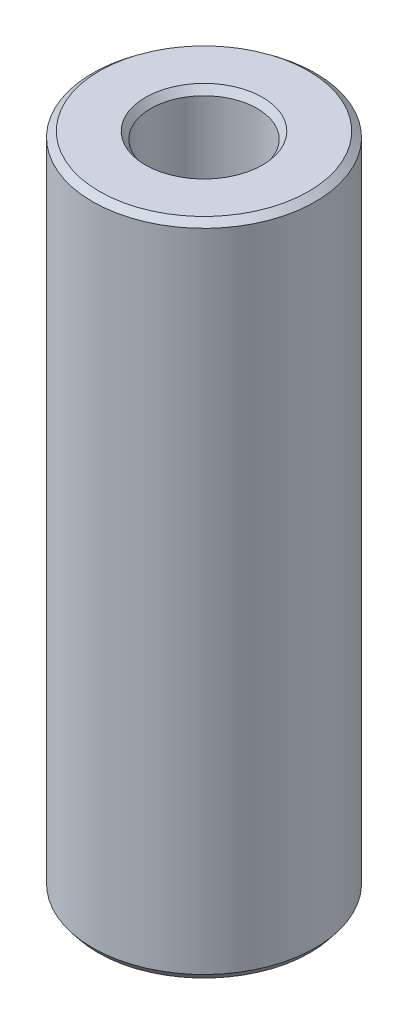
ISO-10303-21;
HEADER;
FILE_DESCRIPTION(('STEP AP214'),'2;1');
FILE_NAME('part.step','',(''),(''),'','','');
FILE_SCHEMA(('AUTOMOTIVE_DESIGN { 1 0 10303 214 1 1 1 1 }'));
ENDSEC;
DATA;
#1=APPLICATION_CONTEXT('core data for automotive mechanical design processes');
#2=APPLICATION_PROTOCOL_DEFINITION('international standard','automotive_design',2000,#1);
#3=PRODUCT_CONTEXT('',#1,'mechanical');
#4=PRODUCT('Part','Part','',(#3));
#5=PRODUCT_RELATED_PRODUCT_CATEGORY('part','',(#4));
#6=PRODUCT_DEFINITION_FORMATION('','',#4);
#7=PRODUCT_DEFINITION_CONTEXT('part definition',#1,'design');
#8=PRODUCT_DEFINITION('design','',#6,#7);
#9=PRODUCT_DEFINITION_SHAPE('','',#8);
#10=(LENGTH_UNIT() NAMED_UNIT(*) SI_UNIT(.MILLI.,.METRE.));
#11=(NAMED_UNIT(*) PLANE_ANGLE_UNIT() SI_UNIT($,.RADIAN.));
#12=(NAMED_UNIT(*) SI_UNIT($,.STERADIAN.) SOLID_ANGLE_UNIT());
#13=UNCERTAINTY_MEASURE_WITH_UNIT(LENGTH_MEASURE(1.E-05),#10,'distance_accuracy_value','');
#14=(GEOMETRIC_REPRESENTATION_CONTEXT(3) GLOBAL_UNCERTAINTY_ASSIGNED_CONTEXT((#13)) GLOBAL_UNIT_ASSIGNED_CONTEXT((#10,
#11,#12)) REPRESENTATION_CONTEXT('',''));
#15=CARTESIAN_POINT('',(0.,0.,0.));
#16=DIRECTION('',(0.,0.,1.));
#17=DIRECTION('',(1.,0.,0.));
#18=AXIS2_PLACEMENT_3D('',#15,#16,#17);
#19=CARTESIAN_POINT('',(0.,339.917908390047,0.));
#20=DIRECTION('',(0.,-1.,0.));
#21=DIRECTION('',(0.,0.,-1.));
#22=AXIS2_PLACEMENT_3D('',#19,#20,#21);
#23=CYLINDRICAL_SURFACE('',#22,57.5);
#24=CARTESIAN_POINT('',(0.,3.57437634379942,0.));
#25=DIRECTION('',(0.,1.,0.));
#26=DIRECTION('',(0.,0.,1.));
#27=AXIS2_PLACEMENT_3D('',#24,#25,#26);
#28=CIRCLE('',#27,57.5);
#29=CARTESIAN_POINT('',(0.,3.57437634379942,57.5));
#30=VERTEX_POINT('',#29);
#31=EDGE_CURVE('E10',#30,#30,#28,.T.);
#32=ORIENTED_EDGE('',*,*,#31,.T.);
#33=EDGE_LOOP('',(#32));
#34=FACE_BOUND('',#33,.T.);
#35=CARTESIAN_POINT('',(0.,337.131513757135,0.));
#36=DIRECTION('',(0.,1.,0.));
#37=DIRECTION('',(0.,0.,1.));
#38=AXIS2_PLACEMENT_3D('',#35,#36,#37);
#39=CIRCLE('',#38,57.5);
#40=CARTESIAN_POINT('',(0.,337.131513757135,57.5));
#41=VERTEX_POINT('',#40);
#42=EDGE_CURVE('E50',#41,#41,#39,.F.);
#43=ORIENTED_EDGE('',*,*,#42,.T.);
#44=EDGE_LOOP('',(#43));
#45=FACE_BOUND('',#44,.T.);
#46=ADVANCED_FACE('F39',(#34,#45),#23,.T.);
#47=CARTESIAN_POINT('',(0.,339.917908390047,0.));
#48=DIRECTION('',(0.,1.,0.));
#49=DIRECTION('',(0.,0.,1.));
#50=AXIS2_PLACEMENT_3D('',#47,#48,#49);
#51=PLANE('',#50);
#52=CARTESIAN_POINT('',(0.,339.917908390047,0.));
#53=DIRECTION('',(0.,1.,0.));
#54=DIRECTION('',(0.,0.,1.));
#55=AXIS2_PLACEMENT_3D('',#52,#53,#54);
#56=CIRCLE('',#55,30.2470972471601);
#57=CARTESIAN_POINT('',(0.,339.917908390047,30.2470972471601));
#58=VERTEX_POINT('',#57);
#59=EDGE_CURVE('E58',#58,#58,#56,.F.);
#60=ORIENTED_EDGE('',*,*,#59,.T.);
#61=EDGE_LOOP('',(#60));
#62=FACE_BOUND('',#61,.T.);
#63=CARTESIAN_POINT('',(0.,339.917908390047,0.));
#64=DIRECTION('',(0.,1.,0.));
#65=DIRECTION('',(0.,0.,1.));
#66=AXIS2_PLACEMENT_3D('',#63,#64,#65);
#67=CIRCLE('',#66,53.9256236562005);
#68=CARTESIAN_POINT('',(0.,339.917908390047,53.9256236562005));
#69=VERTEX_POINT('',#68);
#70=EDGE_CURVE('E61',#69,#69,#67,.T.);
#71=ORIENTED_EDGE('',*,*,#70,.T.);
#72=EDGE_LOOP('',(#71));
#73=FACE_BOUND('',#72,.T.);
#74=ADVANCED_FACE('F88',(#62,#73),#51,.T.);
#75=CARTESIAN_POINT('',(0.,0.,0.));
#76=DIRECTION('',(0.,1.,0.));
#77=DIRECTION('',(0.,0.,1.));
#78=AXIS2_PLACEMENT_3D('',#75,#76,#77);
#79=PLANE('',#78);
#80=CARTESIAN_POINT('',(0.,0.,0.));
#81=DIRECTION('',(0.,1.,0.));
#82=DIRECTION('',(0.,0.,1.));
#83=AXIS2_PLACEMENT_3D('',#80,#81,#82);
#84=CIRCLE('',#83,31.0350789580479);
#85=CARTESIAN_POINT('',(0.,0.,31.0350789580479));
#86=VERTEX_POINT('',#85);
#87=EDGE_CURVE('E51',#86,#86,#84,.T.);
#88=ORIENTED_EDGE('',*,*,#87,.T.);
#89=EDGE_LOOP('',(#88));
#90=FACE_BOUND('',#89,.T.);
#91=CARTESIAN_POINT('',(0.,0.,0.));
#92=DIRECTION('',(0.,1.,0.));
#93=DIRECTION('',(0.,0.,1.));
#94=AXIS2_PLACEMENT_3D('',#91,#92,#93);
#95=CIRCLE('',#94,54.7136053670885);
#96=CARTESIAN_POINT('',(0.,0.,54.7136053670885));
#97=VERTEX_POINT('',#96);
#98=EDGE_CURVE('E54',#97,#97,#95,.F.);
#99=ORIENTED_EDGE('',*,*,#98,.T.);
#100=EDGE_LOOP('',(#99));
#101=FACE_BOUND('',#100,.T.);
#102=ADVANCED_FACE('F83',(#90,#101),#79,.F.);
#103=CARTESIAN_POINT('',(0.,339.917908390047,0.));
#104=DIRECTION('',(0.,-1.,0.));
#105=DIRECTION('',(0.,0.,-1.));
#106=AXIS2_PLACEMENT_3D('',#103,#104,#105);
#107=CYLINDRICAL_SURFACE('',#106,27.4607026142485);
#108=CARTESIAN_POINT('',(0.,336.343532046247,0.));
#109=DIRECTION('',(0.,1.,0.));
#110=DIRECTION('',(0.,0.,1.));
#111=AXIS2_PLACEMENT_3D('',#108,#109,#110);
#112=CIRCLE('',#111,27.4607026142485);
#113=CARTESIAN_POINT('',(0.,336.343532046247,27.4607026142485));
#114=VERTEX_POINT('',#113);
#115=EDGE_CURVE('E67',#114,#114,#112,.T.);
#116=ORIENTED_EDGE('',*,*,#115,.T.);
#117=EDGE_LOOP('',(#116));
#118=FACE_BOUND('',#117,.T.);
#119=CARTESIAN_POINT('',(0.,2.78639463291158,0.));
#120=DIRECTION('',(0.,1.,0.));
#121=DIRECTION('',(0.,0.,1.));
#122=AXIS2_PLACEMENT_3D('',#119,#120,#121);
#123=CIRCLE('',#122,27.4607026142485);
#124=CARTESIAN_POINT('',(0.,2.78639463291158,27.4607026142485));
#125=VERTEX_POINT('',#124);
#126=EDGE_CURVE('E69',#125,#125,#123,.F.);
#127=ORIENTED_EDGE('',*,*,#126,.T.);
#128=EDGE_LOOP('',(#127));
#129=FACE_BOUND('',#128,.T.);
#130=ADVANCED_FACE('F71',(#118,#129),#107,.F.);
#131=CARTESIAN_POINT('',(0.,336.343532046247,0.));
#132=DIRECTION('',(0.,1.,0.));
#133=DIRECTION('',(0.,0.,1.));
#134=AXIS2_PLACEMENT_3D('',#131,#132,#133);
#135=CONICAL_SURFACE('',#134,27.4607026142485,0.662144633840698);
#136=CARTESIAN_POINT('',(0.,339.917908390047,30.2470972471601));
#137=CARTESIAN_POINT('',(0.,339.880675303132,30.2180723030672));
#138=CARTESIAN_POINT('',(0.,339.843442216218,30.1890473589744));
#139=CARTESIAN_POINT('',(0.,339.768976042388,30.1309974707888));
#140=CARTESIAN_POINT('',(0.,339.731742955474,30.1019725266959));
#141=CARTESIAN_POINT('',(0.,339.657276781645,30.0439226385103));
#142=CARTESIAN_POINT('',(0.,339.62004369473,30.0148976944174));
#143=CARTESIAN_POINT('',(0.,339.545577520901,29.9568478062318));
#144=CARTESIAN_POINT('',(0.,339.508344433986,29.927822862139));
#145=CARTESIAN_POINT('',(0.,339.433878260157,29.8697729739533));
#146=CARTESIAN_POINT('',(0.,339.396645173243,29.8407480298605));
#147=CARTESIAN_POINT('',(0.,339.322178999413,29.7826981416748));
#148=CARTESIAN_POINT('',(0.,339.284945912499,29.753673197582));
#149=CARTESIAN_POINT('',(0.,339.21047973867,29.6956233093963));
#150=CARTESIAN_POINT('',(0.,339.173246651755,29.6665983653035));
#151=CARTESIAN_POINT('',(0.,339.098780477926,29.6085484771178));
#152=CARTESIAN_POINT('',(0.,339.061547391011,29.579523533025));
#153=CARTESIAN_POINT('',(0.,338.987081217182,29.5214736448393));
#154=CARTESIAN_POINT('',(0.,338.949848130268,29.4924487007465));
#155=CARTESIAN_POINT('',(0.,338.875381956439,29.4343988125609));
#156=CARTESIAN_POINT('',(0.,338.838148869524,29.405373868468));
#157=CARTESIAN_POINT('',(0.,338.763682695695,29.3473239802824));
#158=CARTESIAN_POINT('',(0.,338.72644960878,29.3182990361895));
#159=CARTESIAN_POINT('',(0.,338.651983434951,29.2602491480039));
#160=CARTESIAN_POINT('',(0.,338.614750348036,29.2312242039111));
#161=CARTESIAN_POINT('',(0.,338.540284174207,29.1731743157254));
#162=CARTESIAN_POINT('',(0.,338.503051087293,29.1441493716326));
#163=CARTESIAN_POINT('',(0.,338.428584913464,29.0860994834469));
#164=CARTESIAN_POINT('',(0.,338.391351826549,29.0570745393541));
#165=CARTESIAN_POINT('',(0.,338.31688565272,28.9990246511684));
#166=CARTESIAN_POINT('',(0.,338.279652565805,28.9699997070756));
#167=CARTESIAN_POINT('',(0.,338.205186391976,28.9119498188899));
#168=CARTESIAN_POINT('',(0.,338.167953305062,28.8829248747971));
#169=CARTESIAN_POINT('',(0.,338.093487131232,28.8248749866114));
#170=CARTESIAN_POINT('',(0.,338.056254044318,28.7958500425186));
#171=CARTESIAN_POINT('',(0.,337.981787870489,28.737800154333));
#172=CARTESIAN_POINT('',(0.,337.944554783574,28.7087752102401));
#173=CARTESIAN_POINT('',(0.,337.870088609745,28.6507253220545));
#174=CARTESIAN_POINT('',(0.,337.83285552283,28.6217003779616));
#175=CARTESIAN_POINT('',(0.,337.758389349001,28.563650489776));
#176=CARTESIAN_POINT('',(0.,337.721156262087,28.5346255456831));
#177=CARTESIAN_POINT('',(0.,337.646690088257,28.4765756574975));
#178=CARTESIAN_POINT('',(0.,337.609457001343,28.4475507134047));
#179=CARTESIAN_POINT('',(0.,337.534990827514,28.389500825219));
#180=CARTESIAN_POINT('',(0.,337.497757740599,28.3604758811262));
#181=CARTESIAN_POINT('',(0.,337.42329156677,28.3024259929405));
#182=CARTESIAN_POINT('',(0.,337.386058479855,28.2734010488477));
#183=CARTESIAN_POINT('',(0.,337.311592306026,28.215351160662));
#184=CARTESIAN_POINT('',(0.,337.274359219112,28.1863262165692));
#185=CARTESIAN_POINT('',(0.,337.199893045283,28.1282763283835));
#186=CARTESIAN_POINT('',(0.,337.162659958368,28.0992513842907));
#187=CARTESIAN_POINT('',(0.,337.088193784539,28.041201496105));
#188=CARTESIAN_POINT('',(0.,337.050960697624,28.0121765520122));
#189=CARTESIAN_POINT('',(0.,336.976494523795,27.9541266638266));
#190=CARTESIAN_POINT('',(0.,336.93926143688,27.9251017197337));
#191=CARTESIAN_POINT('',(0.,336.864795263051,27.8670518315481));
#192=CARTESIAN_POINT('',(0.,336.827562176137,27.8380268874552));
#193=CARTESIAN_POINT('',(0.,336.753096002308,27.7799769992696));
#194=CARTESIAN_POINT('',(0.,336.715862915393,27.7509520551768));
#195=CARTESIAN_POINT('',(0.,336.641396741564,27.6929021669911));
#196=CARTESIAN_POINT('',(0.,336.604163654649,27.6638772228983));
#197=CARTESIAN_POINT('',(0.,336.52969748082,27.6058273347126));
#198=CARTESIAN_POINT('',(0.,336.492464393905,27.5768023906198));
#199=CARTESIAN_POINT('',(0.,336.417998220076,27.5187525024341));
#200=CARTESIAN_POINT('',(0.,336.380765133162,27.4897275583413));
#201=CARTESIAN_POINT('',(0.,336.343532046247,27.4607026142485));
#202=B_SPLINE_CURVE_WITH_KNOTS('',3,(#136,#137,#138,#139,#140,#141,#142,#143,#144,#145,#146,
#147,#148,#149,#150,#151,#152,#153,#154,#155,#156,#157,#158,#159,#160,#161,#162,#163,#164,#165,
#166,#167,#168,#169,#170,#171,#172,#173,#174,#175,#176,#177,#178,#179,#180,#181,#182,#183,#184,
#185,#186,#187,#188,#189,#190,#191,#192,#193,#194,#195,#196,#197,#198,#199,#200,#201),
.UNSPECIFIED.,.F.,.F.,(4,2,2,2,2,2,2,2,2,2,2,2,2,2,2,2,2,2,2,2,2,2,2,2,2,2,2,2,2,2,2,2,4),(0.,
0.141628921011994,0.283257842023988,0.424886763035982,0.566515684047973,0.708144605059967,
0.849773526072005,0.991402447083999,1.13303136809599,1.27466028910798,1.41628921011998,
1.55791813113202,1.69954705214401,1.841175973156,1.982804894168,2.12443381517999,
2.26606273619203,2.40769165720402,2.54932057821601,2.69094949922801,2.83257842024,
2.974207341252,3.11583626226403,3.25746518327603,3.39909410428802,3.54072302530001,
3.68235194631201,3.82398086732404,3.96560978833604,4.10723870934803,4.24886763036002,
4.39049655137202,4.53212547238401),.UNSPECIFIED.);
#203=EDGE_CURVE('BSEAM77',#58,#114,#202,.T.);
#204=ORIENTED_EDGE('',*,*,#59,.F.);
#205=ORIENTED_EDGE('',*,*,#115,.F.);
#206=ORIENTED_EDGE('',*,*,#203,.T.);
#207=ORIENTED_EDGE('',*,*,#203,.F.);
#208=EDGE_LOOP('',(#204,#206,#205,#207));
#209=FACE_BOUND('',#208,.T.);
#210=ADVANCED_FACE('F77',(#209),#135,.F.);
#211=CARTESIAN_POINT('',(0.,0.,0.));
#212=DIRECTION('',(0.,-1.,0.));
#213=DIRECTION('',(0.,0.,-1.));
#214=AXIS2_PLACEMENT_3D('',#211,#212,#213);
#215=CONICAL_SURFACE('',#214,31.0350789580479,0.908651692954189);
#216=ORIENTED_EDGE('',*,*,#126,.F.);
#217=EDGE_LOOP('',(#216));
#218=FACE_BOUND('',#217,.T.);
#219=ORIENTED_EDGE('',*,*,#87,.F.);
#220=EDGE_LOOP('',(#219));
#221=FACE_BOUND('',#220,.T.);
#222=ADVANCED_FACE('F73',(#218,#221),#215,.F.);
#223=CARTESIAN_POINT('',(0.,3.57437634379942,0.));
#224=DIRECTION('',(0.,1.,0.));
#225=DIRECTION('',(0.,0.,1.));
#226=AXIS2_PLACEMENT_3D('',#223,#224,#225);
#227=CONICAL_SURFACE('',#226,57.5,0.662144633840695);
#228=CARTESIAN_POINT('',(0.,0.,54.7136053670885));
#229=CARTESIAN_POINT('',(0.,0.0372330869145788,54.7426303111813));
#230=CARTESIAN_POINT('',(0.,0.0744661738291554,54.7716552552742));
#231=CARTESIAN_POINT('',(0.,0.148932347658309,54.8297051434598));
#232=CARTESIAN_POINT('',(0.,0.186165434572886,54.8587300875526));
#233=CARTESIAN_POINT('',(0.,0.26063160840204,54.9167799757383));
#234=CARTESIAN_POINT('',(0.,0.297864695316619,54.9458049198311));
#235=CARTESIAN_POINT('',(0.,0.372330869145773,55.0038548080168));
#236=CARTESIAN_POINT('',(0.,0.40956395606035,55.0328797521096));
#237=CARTESIAN_POINT('',(0.,0.484030129889504,55.0909296402953));
#238=CARTESIAN_POINT('',(0.,0.521263216804082,55.1199545843881));
#239=CARTESIAN_POINT('',(0.,0.595729390633237,55.1780044725737));
#240=CARTESIAN_POINT('',(0.,0.632962477547815,55.2070294166666));
#241=CARTESIAN_POINT('',(0.,0.707428651376969,55.2650793048522));
#242=CARTESIAN_POINT('',(0.,0.744661738291545,55.2941042489451));
#243=CARTESIAN_POINT('',(0.,0.8191279121207,55.3521541371307));
#244=CARTESIAN_POINT('',(0.,0.856360999035279,55.3811790812235));
#245=CARTESIAN_POINT('',(0.,0.930827172864433,55.4392289694092));
#246=CARTESIAN_POINT('',(0.,0.96806025977901,55.468253913502));
#247=CARTESIAN_POINT('',(0.,1.04252643360816,55.5263038016877));
#248=CARTESIAN_POINT('',(0.,1.07975952052274,55.5553287457805));
#249=CARTESIAN_POINT('',(0.,1.1542256943519,55.6133786339662));
#250=CARTESIAN_POINT('',(0.,1.19145878126647,55.642403578059));
#251=CARTESIAN_POINT('',(0.,1.26592495509563,55.7004534662447));
#252=CARTESIAN_POINT('',(0.,1.30315804201021,55.7294784103375));
#253=CARTESIAN_POINT('',(0.,1.37762421583936,55.7875282985231));
#254=CARTESIAN_POINT('',(0.,1.41485730275394,55.816553242616));
#255=CARTESIAN_POINT('',(0.,1.48932347658309,55.8746031308016));
#256=CARTESIAN_POINT('',(0.,1.52655656349767,55.9036280748945));
#257=CARTESIAN_POINT('',(0.,1.60102273732682,55.9616779630801));
#258=CARTESIAN_POINT('',(0.,1.6382558242414,55.9907029071729));
#259=CARTESIAN_POINT('',(0.,1.71272199807056,56.0487527953586));
#260=CARTESIAN_POINT('',(0.,1.74995508498513,56.0777777394514));
#261=CARTESIAN_POINT('',(0.,1.82442125881429,56.1358276276371));
#262=CARTESIAN_POINT('',(0.,1.86165434572887,56.1648525717299));
#263=CARTESIAN_POINT('',(0.,1.93612051955802,56.2229024599156));
#264=CARTESIAN_POINT('',(0.,1.9733536064726,56.2519274040084));
#265=CARTESIAN_POINT('',(0.,2.04781978030175,56.309977292194));
#266=CARTESIAN_POINT('',(0.,2.08505286721633,56.3390022362869));
#267=CARTESIAN_POINT('',(0.,2.15951904104548,56.3970521244725));
#268=CARTESIAN_POINT('',(0.,2.19675212796006,56.4260770685654));
#269=CARTESIAN_POINT('',(0.,2.27121830178922,56.484126956751));
#270=CARTESIAN_POINT('',(0.,2.3084513887038,56.5131519008438));
#271=CARTESIAN_POINT('',(0.,2.38291756253295,56.5712017890295));
#272=CARTESIAN_POINT('',(0.,2.42015064944753,56.6002267331223));
#273=CARTESIAN_POINT('',(0.,2.49461682327668,56.658276621308));
#274=CARTESIAN_POINT('',(0.,2.53184991019126,56.6873015654008));
#275=CARTESIAN_POINT('',(0.,2.60631608402041,56.7453514535865));
#276=CARTESIAN_POINT('',(0.,2.64354917093499,56.7743763976793));
#277=CARTESIAN_POINT('',(0.,2.71801534476414,56.832426285865));
#278=CARTESIAN_POINT('',(0.,2.75524843167872,56.8614512299578));
#279=CARTESIAN_POINT('',(0.,2.82971460550788,56.9195011181434));
#280=CARTESIAN_POINT('',(0.,2.86694769242245,56.9485260622363));
#281=CARTESIAN_POINT('',(0.,2.94141386625161,57.0065759504219));
#282=CARTESIAN_POINT('',(0.,2.97864695316619,57.0356008945148));
#283=CARTESIAN_POINT('',(0.,3.05311312699534,57.0936507827004));
#284=CARTESIAN_POINT('',(0.,3.09034621390992,57.1226757267932));
#285=CARTESIAN_POINT('',(0.,3.16481238773907,57.1807256149789));
#286=CARTESIAN_POINT('',(0.,3.20204547465365,57.2097505590717));
#287=CARTESIAN_POINT('',(0.,3.2765116484828,57.2678004472574));
#288=CARTESIAN_POINT('',(0.,3.31374473539738,57.2968253913502));
#289=CARTESIAN_POINT('',(0.,3.38821090922654,57.3548752795359));
#290=CARTESIAN_POINT('',(0.,3.42544399614111,57.3839002236287));
#291=CARTESIAN_POINT('',(0.,3.49991016997027,57.4419501118144));
#292=CARTESIAN_POINT('',(0.,3.53714325688484,57.4709750559072));
#293=CARTESIAN_POINT('',(0.,3.57437634379942,57.5));
#294=B_SPLINE_CURVE_WITH_KNOTS('',3,(#228,#229,#230,#231,#232,#233,#234,#235,#236,#237,#238,
#239,#240,#241,#242,#243,#244,#245,#246,#247,#248,#249,#250,#251,#252,#253,#254,#255,#256,#257,
#258,#259,#260,#261,#262,#263,#264,#265,#266,#267,#268,#269,#270,#271,#272,#273,#274,#275,#276,
#277,#278,#279,#280,#281,#282,#283,#284,#285,#286,#287,#288,#289,#290,#291,#292,#293),
.UNSPECIFIED.,.F.,.F.,(4,2,2,2,2,2,2,2,2,2,2,2,2,2,2,2,2,2,2,2,2,2,2,2,2,2,2,2,2,2,2,2,4),(0.,
0.141628921011995,0.283257842023994,0.42488676303599,0.566515684047989,0.708144605059984,
0.849773526071979,0.991402447083979,1.13303136809597,1.27466028910797,1.41628921011997,
1.55791813113196,1.69954705214396,1.84117597315596,1.98280489416796,2.12443381517995,
2.26606273619195,2.40769165720395,2.54932057821594,2.69094949922794,2.83257842023994,
2.97420734125193,3.11583626226393,3.25746518327592,3.39909410428792,3.54072302529992,
3.68235194631192,3.82398086732391,3.96560978833591,4.10723870934791,4.2488676303599,
4.3904965513719,4.5321254723839),.UNSPECIFIED.);
#295=EDGE_CURVE('BSEAM76',#97,#30,#294,.T.);
#296=ORIENTED_EDGE('',*,*,#98,.F.);
#297=ORIENTED_EDGE('',*,*,#31,.F.);
#298=ORIENTED_EDGE('',*,*,#295,.T.);
#299=ORIENTED_EDGE('',*,*,#295,.F.);
#300=EDGE_LOOP('',(#296,#298,#297,#299));
#301=FACE_BOUND('',#300,.T.);
#302=ADVANCED_FACE('F76',(#301),#227,.T.);
#303=CARTESIAN_POINT('',(0.,339.917908390047,0.));
#304=DIRECTION('',(0.,-1.,0.));
#305=DIRECTION('',(0.,0.,-1.));
#306=AXIS2_PLACEMENT_3D('',#303,#304,#305);
#307=CONICAL_SURFACE('',#306,53.9256236562005,0.908651692954197);
#308=ORIENTED_EDGE('',*,*,#42,.F.);
#309=EDGE_LOOP('',(#308));
#310=FACE_BOUND('',#309,.T.);
#311=ORIENTED_EDGE('',*,*,#70,.F.);
#312=EDGE_LOOP('',(#311));
#313=FACE_BOUND('',#312,.T.);
#314=ADVANCED_FACE('F45',(#310,#313),#307,.T.);
#315=CLOSED_SHELL('',(#46,#74,#102,#130,#210,#222,#302,#314));
#316=MANIFOLD_SOLID_BREP('B2',#315);
#317=ADVANCED_BREP_SHAPE_REPRESENTATION('',(#18,#316),#14);
#318=SHAPE_DEFINITION_REPRESENTATION(#9,#317);
ENDSEC;
END-ISO-10303-21;
